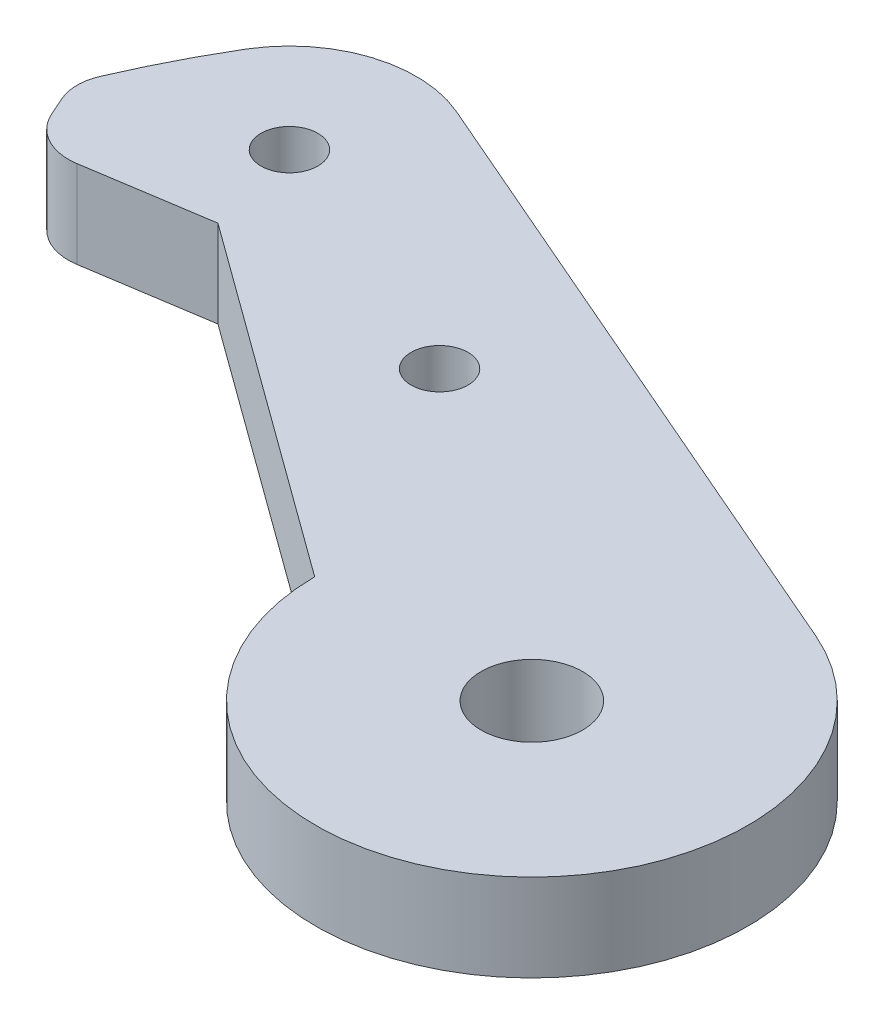
ISO-10303-21;
HEADER;
FILE_DESCRIPTION(('STEP AP214'),'2;1');
FILE_NAME('part.step','',(''),(''),'','','');
FILE_SCHEMA(('AUTOMOTIVE_DESIGN { 1 0 10303 214 1 1 1 1 }'));
ENDSEC;
DATA;
#1=APPLICATION_CONTEXT('core data for automotive mechanical design processes');
#2=APPLICATION_PROTOCOL_DEFINITION('international standard','automotive_design',2000,#1);
#3=PRODUCT_CONTEXT('',#1,'mechanical');
#4=PRODUCT('Part','Part','',(#3));
#5=PRODUCT_RELATED_PRODUCT_CATEGORY('part','',(#4));
#6=PRODUCT_DEFINITION_FORMATION('','',#4);
#7=PRODUCT_DEFINITION_CONTEXT('part definition',#1,'design');
#8=PRODUCT_DEFINITION('design','',#6,#7);
#9=PRODUCT_DEFINITION_SHAPE('','',#8);
#10=(LENGTH_UNIT() NAMED_UNIT(*) SI_UNIT(.MILLI.,.METRE.));
#11=(NAMED_UNIT(*) PLANE_ANGLE_UNIT() SI_UNIT($,.RADIAN.));
#12=(NAMED_UNIT(*) SI_UNIT($,.STERADIAN.) SOLID_ANGLE_UNIT());
#13=UNCERTAINTY_MEASURE_WITH_UNIT(LENGTH_MEASURE(1.E-05),#10,'distance_accuracy_value','');
#14=(GEOMETRIC_REPRESENTATION_CONTEXT(3) GLOBAL_UNCERTAINTY_ASSIGNED_CONTEXT((#13)) GLOBAL_UNIT_ASSIGNED_CONTEXT((#10,
#11,#12)) REPRESENTATION_CONTEXT('',''));
#15=CARTESIAN_POINT('',(0.,0.,0.));
#16=DIRECTION('',(0.,0.,1.));
#17=DIRECTION('',(1.,0.,0.));
#18=AXIS2_PLACEMENT_3D('',#15,#16,#17);
#19=CARTESIAN_POINT('',(0.,5.461,0.));
#20=DIRECTION('',(0.,1.,0.));
#21=DIRECTION('',(0.,0.,1.));
#22=AXIS2_PLACEMENT_3D('',#19,#20,#21);
#23=PLANE('',#22);
#24=CARTESIAN_POINT('',(0.,5.461,0.));
#25=DIRECTION('',(0.,1.,0.));
#26=DIRECTION('',(0.,0.,1.));
#27=AXIS2_PLACEMENT_3D('',#24,#25,#26);
#28=CIRCLE('',#27,3.175);
#29=CARTESIAN_POINT('',(0.,5.461,3.175));
#30=VERTEX_POINT('',#29);
#31=EDGE_CURVE('E198',#30,#30,#28,.T.);
#32=ORIENTED_EDGE('',*,*,#31,.F.);
#33=EDGE_LOOP('',(#32));
#34=FACE_BOUND('',#33,.T.);
#35=CARTESIAN_POINT('',(0.,5.461,0.));
#36=DIRECTION('',(0.,1.,0.));
#37=DIRECTION('',(0.,0.,1.));
#38=AXIS2_PLACEMENT_3D('',#35,#36,#37);
#39=CIRCLE('',#38,13.5);
#40=CARTESIAN_POINT('',(-13.4997935259034,5.461,0.074664301893318));
#41=VERTEX_POINT('',#40);
#42=CARTESIAN_POINT('',(5.36363887672502,5.461,-12.3887601478148));
#43=VERTEX_POINT('',#42);
#44=EDGE_CURVE('E153',#41,#43,#39,.T.);
#45=ORIENTED_EDGE('',*,*,#44,.T.);
#46=DIRECTION('',(-0.917685936875169,0.,-0.397306583461113));
#47=VECTOR('',#46,1.);
#48=CARTESIAN_POINT('',(-34.2596328863461,5.461,-29.5434163293646));
#49=LINE('',#48,#47);
#50=CARTESIAN_POINT('',(-34.2596328863461,5.461,-29.5434163293646));
#51=VERTEX_POINT('',#50);
#52=EDGE_CURVE('E96',#43,#51,#49,.T.);
#53=ORIENTED_EDGE('',*,*,#52,.T.);
#54=CARTESIAN_POINT('',(-37.4132538925687,5.461,-22.2592842054179));
#55=DIRECTION('',(0.,1.,0.));
#56=DIRECTION('',(0.,0.,1.));
#57=AXIS2_PLACEMENT_3D('',#54,#55,#56);
#58=CIRCLE('',#57,7.93750000000001);
#59=CARTESIAN_POINT('',(-44.234733224639,5.461,-26.3177723441387));
#60=VERTEX_POINT('',#59);
#61=EDGE_CURVE('E171',#51,#60,#58,.T.);
#62=ORIENTED_EDGE('',*,*,#61,.T.);
#63=CARTESIAN_POINT('',(0.,5.461,0.));
#64=DIRECTION('',(0.,1.,0.));
#65=DIRECTION('',(0.,0.,-1.));
#66=AXIS2_PLACEMENT_3D('',#63,#64,#65);
#67=CIRCLE('',#66,51.4717083902691);
#68=CARTESIAN_POINT('',(-47.2982832858306,5.461,-20.3029348328316));
#69=VERTEX_POINT('',#68);
#70=EDGE_CURVE('E188',#60,#69,#67,.T.);
#71=ORIENTED_EDGE('',*,*,#70,.T.);
#72=CARTESIAN_POINT('',(-44.5415290553004,5.461,-19.1195895271606));
#73=DIRECTION('',(0.,1.,0.));
#74=DIRECTION('',(0.,0.,1.));
#75=AXIS2_PLACEMENT_3D('',#72,#73,#74);
#76=CIRCLE('',#75,3.);
#77=CARTESIAN_POINT('',(-47.2826830387096,5.461,-17.9005428343551));
#78=VERTEX_POINT('',#77);
#79=EDGE_CURVE('E187',#69,#78,#76,.T.);
#80=ORIENTED_EDGE('',*,*,#79,.T.);
#81=DIRECTION('',(0.406348897601823,0.,0.913717994469729));
#82=VECTOR('',#81,1.);
#83=CARTESIAN_POINT('',(-46.7735184750928,5.461,-16.7556330618206));
#84=LINE('',#83,#82);
#85=CARTESIAN_POINT('',(-46.7735184750928,5.461,-16.7556330618206));
#86=VERTEX_POINT('',#85);
#87=EDGE_CURVE('E118',#78,#86,#84,.T.);
#88=ORIENTED_EDGE('',*,*,#87,.T.);
#89=CARTESIAN_POINT('',(-43.8039349930662,5.461,-18.0762669790265));
#90=DIRECTION('',(0.,1.,0.));
#91=DIRECTION('',(0.,0.,-1.));
#92=AXIS2_PLACEMENT_3D('',#89,#90,#91);
#93=CIRCLE('',#92,3.25);
#94=CARTESIAN_POINT('',(-43.3060770782968,5.461,-14.8646260438188));
#95=VERTEX_POINT('',#94);
#96=EDGE_CURVE('E112',#86,#95,#93,.T.);
#97=ORIENTED_EDGE('',*,*,#96,.T.);
#98=DIRECTION('',(0.988197210833124,0.,-0.153187050698273));
#99=VECTOR('',#98,1.);
#100=CARTESIAN_POINT('',(-43.3060770782968,5.461,-14.8646260438188));
#101=LINE('',#100,#99);
#102=CARTESIAN_POINT('',(-35.6711693791623,5.461,-16.0481640865926));
#103=VERTEX_POINT('',#102);
#104=EDGE_CURVE('E116',#95,#103,#101,.T.);
#105=ORIENTED_EDGE('',*,*,#104,.T.);
#106=DIRECTION('',(0.808767465357848,0.,0.588128546304839));
#107=VECTOR('',#106,1.);
#108=CARTESIAN_POINT('',(-35.6711693791623,5.461,-16.0481640865926));
#109=LINE('',#108,#107);
#110=EDGE_CURVE('E50',#103,#41,#109,.T.);
#111=ORIENTED_EDGE('',*,*,#110,.T.);
#112=EDGE_LOOP('',(#45,#53,#62,#71,#80,#88,#97,#105,#111));
#113=FACE_BOUND('',#112,.T.);
#114=CARTESIAN_POINT('',(-20.8624589223986,5.461,-15.0937174914343));
#115=DIRECTION('',(0.,1.,0.));
#116=DIRECTION('',(0.,0.,1.));
#117=AXIS2_PLACEMENT_3D('',#114,#115,#116);
#118=CIRCLE('',#117,1.778);
#119=CARTESIAN_POINT('',(-20.8624589223986,5.461,-13.3157174914343));
#120=VERTEX_POINT('',#119);
#121=EDGE_CURVE('E140',#120,#120,#118,.T.);
#122=ORIENTED_EDGE('',*,*,#121,.F.);
#123=EDGE_LOOP('',(#122));
#124=FACE_BOUND('',#123,.T.);
#125=CARTESIAN_POINT('',(-37.4132538925687,5.461,-22.2592842054179));
#126=DIRECTION('',(0.,1.,0.));
#127=DIRECTION('',(0.,0.,1.));
#128=AXIS2_PLACEMENT_3D('',#125,#126,#127);
#129=CIRCLE('',#128,1.778);
#130=CARTESIAN_POINT('',(-37.4132538925687,5.461,-20.4812842054179));
#131=VERTEX_POINT('',#130);
#132=EDGE_CURVE('E204',#131,#131,#129,.T.);
#133=ORIENTED_EDGE('',*,*,#132,.F.);
#134=EDGE_LOOP('',(#133));
#135=FACE_BOUND('',#134,.T.);
#136=ADVANCED_FACE('F33',(#34,#113,#124,#135),#23,.T.);
#137=CARTESIAN_POINT('',(0.,0.,0.));
#138=DIRECTION('',(0.,1.,0.));
#139=DIRECTION('',(0.,0.,1.));
#140=AXIS2_PLACEMENT_3D('',#137,#138,#139);
#141=PLANE('',#140);
#142=CARTESIAN_POINT('',(0.,0.,0.));
#143=DIRECTION('',(0.,1.,0.));
#144=DIRECTION('',(0.,0.,1.));
#145=AXIS2_PLACEMENT_3D('',#142,#143,#144);
#146=CIRCLE('',#145,13.5);
#147=CARTESIAN_POINT('',(-13.4997935259034,0.,0.074664301893318));
#148=VERTEX_POINT('',#147);
#149=CARTESIAN_POINT('',(5.36363887672502,0.,-12.3887601478148));
#150=VERTEX_POINT('',#149);
#151=EDGE_CURVE('E136',#148,#150,#146,.T.);
#152=ORIENTED_EDGE('',*,*,#151,.F.);
#153=DIRECTION('',(0.808767465357848,0.,0.588128546304839));
#154=VECTOR('',#153,1.);
#155=CARTESIAN_POINT('',(-35.6711693791623,0.,-16.0481640865926));
#156=LINE('',#155,#154);
#157=CARTESIAN_POINT('',(-35.6711693791623,0.,-16.0481640865926));
#158=VERTEX_POINT('',#157);
#159=EDGE_CURVE('E88',#158,#148,#156,.T.);
#160=ORIENTED_EDGE('',*,*,#159,.F.);
#161=DIRECTION('',(0.988197210833124,0.,-0.153187050698273));
#162=VECTOR('',#161,1.);
#163=CARTESIAN_POINT('',(-43.3060770782968,0.,-14.8646260438188));
#164=LINE('',#163,#162);
#165=CARTESIAN_POINT('',(-43.3060770782968,0.,-14.8646260438188));
#166=VERTEX_POINT('',#165);
#167=EDGE_CURVE('E82',#166,#158,#164,.T.);
#168=ORIENTED_EDGE('',*,*,#167,.F.);
#169=CARTESIAN_POINT('',(-43.8039349930662,0.,-18.0762669790265));
#170=DIRECTION('',(0.,1.,0.));
#171=DIRECTION('',(0.,0.,-1.));
#172=AXIS2_PLACEMENT_3D('',#169,#170,#171);
#173=CIRCLE('',#172,3.25);
#174=CARTESIAN_POINT('',(-46.7735184750928,0.,-16.7556330618206));
#175=VERTEX_POINT('',#174);
#176=EDGE_CURVE('E126',#175,#166,#173,.T.);
#177=ORIENTED_EDGE('',*,*,#176,.F.);
#178=DIRECTION('',(0.406348897601823,0.,0.913717994469729));
#179=VECTOR('',#178,1.);
#180=CARTESIAN_POINT('',(-46.7735184750928,0.,-16.7556330618206));
#181=LINE('',#180,#179);
#182=CARTESIAN_POINT('',(-47.2826830387096,0.,-17.9005428343551));
#183=VERTEX_POINT('',#182);
#184=EDGE_CURVE('E148',#183,#175,#181,.T.);
#185=ORIENTED_EDGE('',*,*,#184,.F.);
#186=CARTESIAN_POINT('',(-44.5415290553004,0.,-19.1195895271606));
#187=DIRECTION('',(0.,1.,0.));
#188=DIRECTION('',(0.,0.,1.));
#189=AXIS2_PLACEMENT_3D('',#186,#187,#188);
#190=CIRCLE('',#189,3.);
#191=CARTESIAN_POINT('',(-47.2982832858306,0.,-20.3029348328316));
#192=VERTEX_POINT('',#191);
#193=EDGE_CURVE('E146',#192,#183,#190,.T.);
#194=ORIENTED_EDGE('',*,*,#193,.F.);
#195=CARTESIAN_POINT('',(0.,0.,0.));
#196=DIRECTION('',(0.,1.,0.));
#197=DIRECTION('',(0.,0.,-1.));
#198=AXIS2_PLACEMENT_3D('',#195,#196,#197);
#199=CIRCLE('',#198,51.4717083902691);
#200=CARTESIAN_POINT('',(-44.234733224639,0.,-26.3177723441387));
#201=VERTEX_POINT('',#200);
#202=EDGE_CURVE('E144',#201,#192,#199,.T.);
#203=ORIENTED_EDGE('',*,*,#202,.F.);
#204=CARTESIAN_POINT('',(-37.4132538925687,0.,-22.2592842054179));
#205=DIRECTION('',(0.,1.,0.));
#206=DIRECTION('',(0.,0.,1.));
#207=AXIS2_PLACEMENT_3D('',#204,#205,#206);
#208=CIRCLE('',#207,7.93750000000001);
#209=CARTESIAN_POINT('',(-34.2596328863461,0.,-29.5434163293646));
#210=VERTEX_POINT('',#209);
#211=EDGE_CURVE('E142',#210,#201,#208,.T.);
#212=ORIENTED_EDGE('',*,*,#211,.F.);
#213=DIRECTION('',(-0.917685936875169,0.,-0.397306583461113));
#214=VECTOR('',#213,1.);
#215=CARTESIAN_POINT('',(-34.2596328863461,0.,-29.5434163293646));
#216=LINE('',#215,#214);
#217=EDGE_CURVE('E139',#150,#210,#216,.T.);
#218=ORIENTED_EDGE('',*,*,#217,.F.);
#219=EDGE_LOOP('',(#152,#160,#168,#177,#185,#194,#203,#212,#218));
#220=FACE_BOUND('',#219,.T.);
#221=CARTESIAN_POINT('',(-20.8624589223986,0.,-15.0937174914343));
#222=DIRECTION('',(0.,1.,0.));
#223=DIRECTION('',(0.,0.,1.));
#224=AXIS2_PLACEMENT_3D('',#221,#222,#223);
#225=CIRCLE('',#224,1.778);
#226=CARTESIAN_POINT('',(-20.8624589223986,0.,-13.3157174914343));
#227=VERTEX_POINT('',#226);
#228=EDGE_CURVE('E195',#227,#227,#225,.T.);
#229=ORIENTED_EDGE('',*,*,#228,.T.);
#230=EDGE_LOOP('',(#229));
#231=FACE_BOUND('',#230,.T.);
#232=CARTESIAN_POINT('',(0.,0.,0.));
#233=DIRECTION('',(0.,1.,0.));
#234=DIRECTION('',(0.,0.,1.));
#235=AXIS2_PLACEMENT_3D('',#232,#233,#234);
#236=CIRCLE('',#235,3.175);
#237=CARTESIAN_POINT('',(0.,0.,3.175));
#238=VERTEX_POINT('',#237);
#239=EDGE_CURVE('E201',#238,#238,#236,.T.);
#240=ORIENTED_EDGE('',*,*,#239,.T.);
#241=EDGE_LOOP('',(#240));
#242=FACE_BOUND('',#241,.T.);
#243=CARTESIAN_POINT('',(-37.4132538925687,0.,-22.2592842054179));
#244=DIRECTION('',(0.,1.,0.));
#245=DIRECTION('',(0.,0.,1.));
#246=AXIS2_PLACEMENT_3D('',#243,#244,#245);
#247=CIRCLE('',#246,1.778);
#248=CARTESIAN_POINT('',(-37.4132538925687,0.,-20.4812842054179));
#249=VERTEX_POINT('',#248);
#250=EDGE_CURVE('E207',#249,#249,#247,.T.);
#251=ORIENTED_EDGE('',*,*,#250,.T.);
#252=EDGE_LOOP('',(#251));
#253=FACE_BOUND('',#252,.T.);
#254=ADVANCED_FACE('F175',(#220,#231,#242,#253),#141,.F.);
#255=CARTESIAN_POINT('',(0.,5.461,0.));
#256=DIRECTION('',(0.,-1.,0.));
#257=DIRECTION('',(0.,0.,-1.));
#258=AXIS2_PLACEMENT_3D('',#255,#256,#257);
#259=CYLINDRICAL_SURFACE('',#258,13.5);
#260=ORIENTED_EDGE('',*,*,#151,.T.);
#261=DIRECTION('',(0.,-1.,0.));
#262=VECTOR('',#261,1.);
#263=CARTESIAN_POINT('',(5.36363887672502,5.461,-12.3887601478148));
#264=LINE('',#263,#262);
#265=EDGE_CURVE('E11',#43,#150,#264,.T.);
#266=ORIENTED_EDGE('',*,*,#265,.F.);
#267=ORIENTED_EDGE('',*,*,#44,.F.);
#268=DIRECTION('',(0.,-1.,0.));
#269=VECTOR('',#268,1.);
#270=CARTESIAN_POINT('',(-13.4997935259034,5.461,0.074664301893318));
#271=LINE('',#270,#269);
#272=EDGE_CURVE('E132',#41,#148,#271,.T.);
#273=ORIENTED_EDGE('',*,*,#272,.T.);
#274=EDGE_LOOP('',(#260,#266,#267,#273));
#275=FACE_BOUND('',#274,.T.);
#276=ADVANCED_FACE('F35',(#275),#259,.T.);
#277=CARTESIAN_POINT('',(-34.2596328863461,5.461,-29.5434163293646));
#278=DIRECTION('',(-0.397306583461113,0.,0.917685936875169));
#279=DIRECTION('',(0.91768593687517,0.,0.397306583461113));
#280=AXIS2_PLACEMENT_3D('',#277,#278,#279);
#281=PLANE('',#280);
#282=ORIENTED_EDGE('',*,*,#217,.T.);
#283=DIRECTION('',(0.,-1.,0.));
#284=VECTOR('',#283,1.);
#285=CARTESIAN_POINT('',(-34.2596328863461,5.461,-29.5434163293646));
#286=LINE('',#285,#284);
#287=EDGE_CURVE('E42',#51,#210,#286,.T.);
#288=ORIENTED_EDGE('',*,*,#287,.F.);
#289=ORIENTED_EDGE('',*,*,#52,.F.);
#290=ORIENTED_EDGE('',*,*,#265,.T.);
#291=EDGE_LOOP('',(#282,#288,#289,#290));
#292=FACE_BOUND('',#291,.T.);
#293=ADVANCED_FACE('F244',(#292),#281,.F.);
#294=CARTESIAN_POINT('',(-37.4132538925687,5.461,-22.2592842054179));
#295=DIRECTION('',(0.,-1.,0.));
#296=DIRECTION('',(0.,0.,-1.));
#297=AXIS2_PLACEMENT_3D('',#294,#295,#296);
#298=CYLINDRICAL_SURFACE('',#297,7.93750000000001);
#299=ORIENTED_EDGE('',*,*,#211,.T.);
#300=DIRECTION('',(0.,-1.,0.));
#301=VECTOR('',#300,1.);
#302=CARTESIAN_POINT('',(-44.234733224639,5.461,-26.3177723441387));
#303=LINE('',#302,#301);
#304=EDGE_CURVE('E163',#60,#201,#303,.T.);
#305=ORIENTED_EDGE('',*,*,#304,.F.);
#306=ORIENTED_EDGE('',*,*,#61,.F.);
#307=ORIENTED_EDGE('',*,*,#287,.T.);
#308=EDGE_LOOP('',(#299,#305,#306,#307));
#309=FACE_BOUND('',#308,.T.);
#310=ADVANCED_FACE('F169',(#309),#298,.T.);
#311=CARTESIAN_POINT('',(0.,5.461,0.));
#312=DIRECTION('',(0.,-1.,0.));
#313=DIRECTION('',(0.,0.,-1.));
#314=AXIS2_PLACEMENT_3D('',#311,#312,#313);
#315=CYLINDRICAL_SURFACE('',#314,51.4717083902691);
#316=ORIENTED_EDGE('',*,*,#202,.T.);
#317=DIRECTION('',(0.,-1.,0.));
#318=VECTOR('',#317,1.);
#319=CARTESIAN_POINT('',(-47.2982832858306,5.461,-20.3029348328316));
#320=LINE('',#319,#318);
#321=EDGE_CURVE('E160',#69,#192,#320,.T.);
#322=ORIENTED_EDGE('',*,*,#321,.F.);
#323=ORIENTED_EDGE('',*,*,#70,.F.);
#324=ORIENTED_EDGE('',*,*,#304,.T.);
#325=EDGE_LOOP('',(#316,#322,#323,#324));
#326=FACE_BOUND('',#325,.T.);
#327=ADVANCED_FACE('F181',(#326),#315,.T.);
#328=CARTESIAN_POINT('',(-44.5415290553004,5.461,-19.1195895271606));
#329=DIRECTION('',(0.,-1.,0.));
#330=DIRECTION('',(0.,0.,-1.));
#331=AXIS2_PLACEMENT_3D('',#328,#329,#330);
#332=CYLINDRICAL_SURFACE('',#331,3.);
#333=ORIENTED_EDGE('',*,*,#193,.T.);
#334=DIRECTION('',(0.,-1.,0.));
#335=VECTOR('',#334,1.);
#336=CARTESIAN_POINT('',(-47.2826830387096,5.461,-17.9005428343551));
#337=LINE('',#336,#335);
#338=EDGE_CURVE('E157',#78,#183,#337,.T.);
#339=ORIENTED_EDGE('',*,*,#338,.F.);
#340=ORIENTED_EDGE('',*,*,#79,.F.);
#341=ORIENTED_EDGE('',*,*,#321,.T.);
#342=EDGE_LOOP('',(#333,#339,#340,#341));
#343=FACE_BOUND('',#342,.T.);
#344=ADVANCED_FACE('F185',(#343),#332,.T.);
#345=CARTESIAN_POINT('',(-46.7735184750928,5.461,-16.7556330618206));
#346=DIRECTION('',(0.913717994469729,0.,-0.406348897601823));
#347=DIRECTION('',(-0.406348897601823,0.,-0.913717994469729));
#348=AXIS2_PLACEMENT_3D('',#345,#346,#347);
#349=PLANE('',#348);
#350=ORIENTED_EDGE('',*,*,#184,.T.);
#351=DIRECTION('',(0.,-1.,0.));
#352=VECTOR('',#351,1.);
#353=CARTESIAN_POINT('',(-46.7735184750928,5.461,-16.7556330618206));
#354=LINE('',#353,#352);
#355=EDGE_CURVE('E127',#86,#175,#354,.T.);
#356=ORIENTED_EDGE('',*,*,#355,.F.);
#357=ORIENTED_EDGE('',*,*,#87,.F.);
#358=ORIENTED_EDGE('',*,*,#338,.T.);
#359=EDGE_LOOP('',(#350,#356,#357,#358));
#360=FACE_BOUND('',#359,.T.);
#361=ADVANCED_FACE('F235',(#360),#349,.F.);
#362=CARTESIAN_POINT('',(-43.8039349930662,5.461,-18.0762669790265));
#363=DIRECTION('',(0.,-1.,0.));
#364=DIRECTION('',(0.,0.,-1.));
#365=AXIS2_PLACEMENT_3D('',#362,#363,#364);
#366=CYLINDRICAL_SURFACE('',#365,3.25);
#367=ORIENTED_EDGE('',*,*,#176,.T.);
#368=DIRECTION('',(0.,-1.,0.));
#369=VECTOR('',#368,1.);
#370=CARTESIAN_POINT('',(-43.3060770782968,5.461,-14.8646260438188));
#371=LINE('',#370,#369);
#372=EDGE_CURVE('E123',#95,#166,#371,.T.);
#373=ORIENTED_EDGE('',*,*,#372,.F.);
#374=ORIENTED_EDGE('',*,*,#96,.F.);
#375=ORIENTED_EDGE('',*,*,#355,.T.);
#376=EDGE_LOOP('',(#367,#373,#374,#375));
#377=FACE_BOUND('',#376,.T.);
#378=ADVANCED_FACE('F124',(#377),#366,.T.);
#379=CARTESIAN_POINT('',(-43.3060770782968,5.461,-14.8646260438188));
#380=DIRECTION('',(-0.153187050698273,0.,-0.988197210833124));
#381=DIRECTION('',(-0.988197210833124,0.,0.153187050698273));
#382=AXIS2_PLACEMENT_3D('',#379,#380,#381);
#383=PLANE('',#382);
#384=ORIENTED_EDGE('',*,*,#167,.T.);
#385=DIRECTION('',(0.,-1.,0.));
#386=VECTOR('',#385,1.);
#387=CARTESIAN_POINT('',(-35.6711693791623,5.461,-16.0481640865926));
#388=LINE('',#387,#386);
#389=EDGE_CURVE('E128',#103,#158,#388,.T.);
#390=ORIENTED_EDGE('',*,*,#389,.F.);
#391=ORIENTED_EDGE('',*,*,#104,.F.);
#392=ORIENTED_EDGE('',*,*,#372,.T.);
#393=EDGE_LOOP('',(#384,#390,#391,#392));
#394=FACE_BOUND('',#393,.T.);
#395=ADVANCED_FACE('F130',(#394),#383,.F.);
#396=CARTESIAN_POINT('',(-35.6711693791623,5.461,-16.0481640865926));
#397=DIRECTION('',(0.588128546304839,0.,-0.808767465357848));
#398=DIRECTION('',(-0.808767465357848,0.,-0.588128546304839));
#399=AXIS2_PLACEMENT_3D('',#396,#397,#398);
#400=PLANE('',#399);
#401=ORIENTED_EDGE('',*,*,#159,.T.);
#402=ORIENTED_EDGE('',*,*,#272,.F.);
#403=ORIENTED_EDGE('',*,*,#110,.F.);
#404=ORIENTED_EDGE('',*,*,#389,.T.);
#405=EDGE_LOOP('',(#401,#402,#403,#404));
#406=FACE_BOUND('',#405,.T.);
#407=ADVANCED_FACE('F228',(#406),#400,.F.);
#408=CARTESIAN_POINT('',(-20.8624589223986,5.461,-15.0937174914343));
#409=DIRECTION('',(0.,-1.,0.));
#410=DIRECTION('',(0.,0.,-1.));
#411=AXIS2_PLACEMENT_3D('',#408,#409,#410);
#412=CYLINDRICAL_SURFACE('',#411,1.778);
#413=ORIENTED_EDGE('',*,*,#121,.T.);
#414=EDGE_LOOP('',(#413));
#415=FACE_BOUND('',#414,.T.);
#416=ORIENTED_EDGE('',*,*,#228,.F.);
#417=EDGE_LOOP('',(#416));
#418=FACE_BOUND('',#417,.T.);
#419=ADVANCED_FACE('F225',(#415,#418),#412,.F.);
#420=CARTESIAN_POINT('',(0.,5.461,0.));
#421=DIRECTION('',(0.,-1.,0.));
#422=DIRECTION('',(0.,0.,-1.));
#423=AXIS2_PLACEMENT_3D('',#420,#421,#422);
#424=CYLINDRICAL_SURFACE('',#423,3.175);
#425=ORIENTED_EDGE('',*,*,#31,.T.);
#426=EDGE_LOOP('',(#425));
#427=FACE_BOUND('',#426,.T.);
#428=ORIENTED_EDGE('',*,*,#239,.F.);
#429=EDGE_LOOP('',(#428));
#430=FACE_BOUND('',#429,.T.);
#431=ADVANCED_FACE('F313',(#427,#430),#424,.F.);
#432=CARTESIAN_POINT('',(-37.4132538925687,5.461,-22.2592842054179));
#433=DIRECTION('',(0.,-1.,0.));
#434=DIRECTION('',(0.,0.,-1.));
#435=AXIS2_PLACEMENT_3D('',#432,#433,#434);
#436=CYLINDRICAL_SURFACE('',#435,1.778);
#437=ORIENTED_EDGE('',*,*,#132,.T.);
#438=EDGE_LOOP('',(#437));
#439=FACE_BOUND('',#438,.T.);
#440=ORIENTED_EDGE('',*,*,#250,.F.);
#441=EDGE_LOOP('',(#440));
#442=FACE_BOUND('',#441,.T.);
#443=ADVANCED_FACE('F213',(#439,#442),#436,.F.);
#444=CLOSED_SHELL('',(#136,#254,#276,#293,#310,#327,#344,#361,#378,#395,#407,#419,#431,#443));
#445=MANIFOLD_SOLID_BREP('B2',#444);
#446=ADVANCED_BREP_SHAPE_REPRESENTATION('',(#18,#445),#14);
#447=SHAPE_DEFINITION_REPRESENTATION(#9,#446);
ENDSEC;
END-ISO-10303-21;
